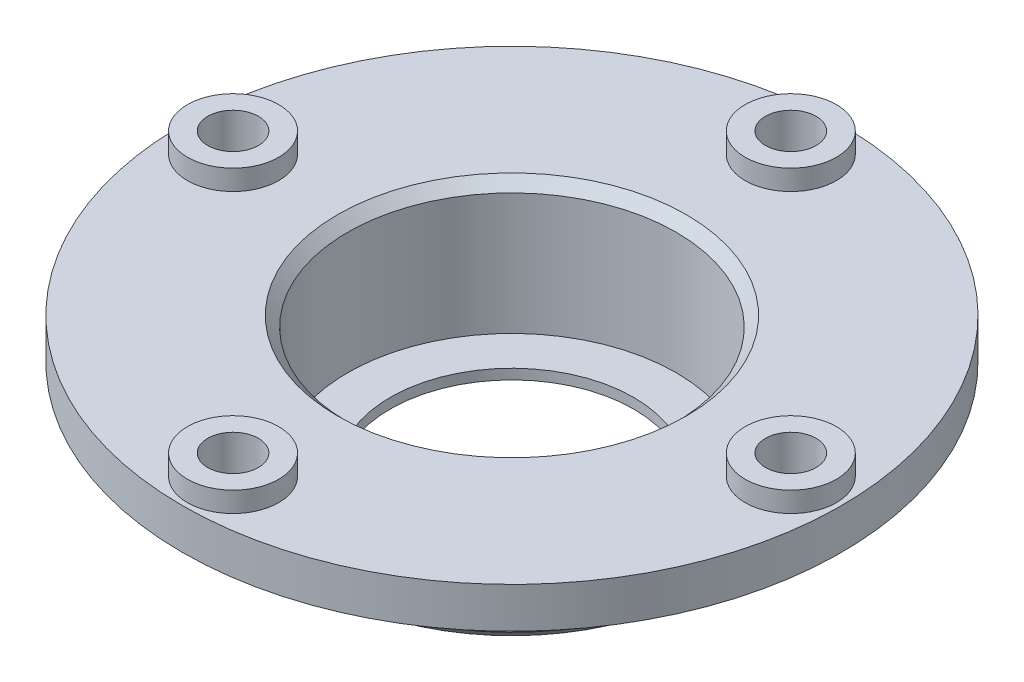
ISO-10303-21;
HEADER;
FILE_DESCRIPTION(('STEP AP214'),'2;1');
FILE_NAME('part.step','',(''),(''),'','','');
FILE_SCHEMA(('AUTOMOTIVE_DESIGN { 1 0 10303 214 1 1 1 1 }'));
ENDSEC;
DATA;
#1=APPLICATION_CONTEXT('core data for automotive mechanical design processes');
#2=APPLICATION_PROTOCOL_DEFINITION('international standard','automotive_design',2000,#1);
#3=PRODUCT_CONTEXT('',#1,'mechanical');
#4=PRODUCT('Part','Part','',(#3));
#5=PRODUCT_RELATED_PRODUCT_CATEGORY('part','',(#4));
#6=PRODUCT_DEFINITION_FORMATION('','',#4);
#7=PRODUCT_DEFINITION_CONTEXT('part definition',#1,'design');
#8=PRODUCT_DEFINITION('design','',#6,#7);
#9=PRODUCT_DEFINITION_SHAPE('','',#8);
#10=(LENGTH_UNIT() NAMED_UNIT(*) SI_UNIT(.MILLI.,.METRE.));
#11=(NAMED_UNIT(*) PLANE_ANGLE_UNIT() SI_UNIT($,.RADIAN.));
#12=(NAMED_UNIT(*) SI_UNIT($,.STERADIAN.) SOLID_ANGLE_UNIT());
#13=UNCERTAINTY_MEASURE_WITH_UNIT(LENGTH_MEASURE(1.E-05),#10,'distance_accuracy_value','');
#14=(GEOMETRIC_REPRESENTATION_CONTEXT(3) GLOBAL_UNCERTAINTY_ASSIGNED_CONTEXT((#13)) GLOBAL_UNIT_ASSIGNED_CONTEXT((#10,
#11,#12)) REPRESENTATION_CONTEXT('',''));
#15=CARTESIAN_POINT('',(0.,0.,0.));
#16=DIRECTION('',(0.,0.,1.));
#17=DIRECTION('',(1.,0.,0.));
#18=AXIS2_PLACEMENT_3D('',#15,#16,#17);
#19=CARTESIAN_POINT('',(0.,9.,0.));
#20=DIRECTION('',(0.,-1.,0.));
#21=DIRECTION('',(0.,0.,-1.));
#22=AXIS2_PLACEMENT_3D('',#19,#20,#21);
#23=CYLINDRICAL_SURFACE('',#22,16.2);
#24=CARTESIAN_POINT('',(0.,13.,0.));
#25=DIRECTION('',(0.,1.,0.));
#26=DIRECTION('',(0.,0.,1.));
#27=AXIS2_PLACEMENT_3D('',#24,#25,#26);
#28=CIRCLE('',#27,16.2);
#29=CARTESIAN_POINT('',(0.,13.,16.2));
#30=VERTEX_POINT('',#29);
#31=EDGE_CURVE('E53',#30,#30,#28,.T.);
#32=ORIENTED_EDGE('',*,*,#31,.T.);
#33=EDGE_LOOP('',(#32));
#34=FACE_BOUND('',#33,.T.);
#35=CARTESIAN_POINT('',(0.,1.,0.));
#36=DIRECTION('',(0.,-1.,0.));
#37=DIRECTION('',(0.,0.,-1.));
#38=AXIS2_PLACEMENT_3D('',#35,#36,#37);
#39=CIRCLE('',#38,16.2);
#40=CARTESIAN_POINT('',(0.,1.,-16.2));
#41=VERTEX_POINT('',#40);
#42=EDGE_CURVE('E120',#41,#41,#39,.T.);
#43=ORIENTED_EDGE('',*,*,#42,.T.);
#44=EDGE_LOOP('',(#43));
#45=FACE_BOUND('',#44,.T.);
#46=ADVANCED_FACE('F37',(#34,#45),#23,.F.);
#47=CARTESIAN_POINT('',(0.,14.,0.));
#48=DIRECTION('',(0.,1.,0.));
#49=DIRECTION('',(0.,0.,1.));
#50=AXIS2_PLACEMENT_3D('',#47,#48,#49);
#51=PLANE('',#50);
#52=CARTESIAN_POINT('',(0.,14.,0.));
#53=DIRECTION('',(0.,1.,0.));
#54=DIRECTION('',(0.,0.,1.));
#55=AXIS2_PLACEMENT_3D('',#52,#53,#54);
#56=CIRCLE('',#55,17.2);
#57=CARTESIAN_POINT('',(0.,14.,17.2));
#58=VERTEX_POINT('',#57);
#59=EDGE_CURVE('E49',#58,#58,#56,.F.);
#60=ORIENTED_EDGE('',*,*,#59,.T.);
#61=EDGE_LOOP('',(#60));
#62=FACE_BOUND('',#61,.T.);
#63=CARTESIAN_POINT('',(27.500000000002,14.,-1.94894085529379E-12));
#64=DIRECTION('',(0.,1.,0.));
#65=DIRECTION('',(0.,0.,1.));
#66=AXIS2_PLACEMENT_3D('',#63,#64,#65);
#67=CIRCLE('',#66,4.50000000000138);
#68=CARTESIAN_POINT('',(27.500000000002,14.,4.49999999999943));
#69=VERTEX_POINT('',#68);
#70=EDGE_CURVE('E107',#69,#69,#67,.T.);
#71=ORIENTED_EDGE('',*,*,#70,.F.);
#72=EDGE_LOOP('',(#71));
#73=FACE_BOUND('',#72,.T.);
#74=CARTESIAN_POINT('',(3.89788171058759E-12,14.,27.5));
#75=DIRECTION('',(0.,1.,0.));
#76=DIRECTION('',(0.,0.,1.));
#77=AXIS2_PLACEMENT_3D('',#74,#75,#76);
#78=CIRCLE('',#77,4.50000000000391);
#79=CARTESIAN_POINT('',(3.89788171058759E-12,14.,32.0000000000039));
#80=VERTEX_POINT('',#79);
#81=EDGE_CURVE('E87',#80,#80,#78,.T.);
#82=ORIENTED_EDGE('',*,*,#81,.F.);
#83=EDGE_LOOP('',(#82));
#84=FACE_BOUND('',#83,.T.);
#85=CARTESIAN_POINT('',(0.,14.,0.));
#86=DIRECTION('',(0.,1.,0.));
#87=DIRECTION('',(0.,0.,1.));
#88=AXIS2_PLACEMENT_3D('',#85,#86,#87);
#89=CIRCLE('',#88,32.5);
#90=CARTESIAN_POINT('',(0.,14.,32.5));
#91=VERTEX_POINT('',#90);
#92=EDGE_CURVE('E83',#91,#91,#89,.T.);
#93=ORIENTED_EDGE('',*,*,#92,.T.);
#94=EDGE_LOOP('',(#93));
#95=FACE_BOUND('',#94,.T.);
#96=CARTESIAN_POINT('',(0.,14.,-27.5));
#97=DIRECTION('',(0.,1.,0.));
#98=DIRECTION('',(0.,0.,1.));
#99=AXIS2_PLACEMENT_3D('',#96,#97,#98);
#100=CIRCLE('',#99,4.5);
#101=CARTESIAN_POINT('',(0.,14.,-23.));
#102=VERTEX_POINT('',#101);
#103=EDGE_CURVE('E98',#102,#102,#100,.T.);
#104=ORIENTED_EDGE('',*,*,#103,.F.);
#105=EDGE_LOOP('',(#104));
#106=FACE_BOUND('',#105,.T.);
#107=CARTESIAN_POINT('',(-27.4999999999981,14.,1.95230863399145E-12));
#108=DIRECTION('',(0.,1.,0.));
#109=DIRECTION('',(0.,0.,1.));
#110=AXIS2_PLACEMENT_3D('',#107,#108,#109);
#111=CIRCLE('',#110,4.50000000000271);
#112=CARTESIAN_POINT('',(-27.4999999999981,14.,4.50000000000466));
#113=VERTEX_POINT('',#112);
#114=EDGE_CURVE('E116',#113,#113,#111,.T.);
#115=ORIENTED_EDGE('',*,*,#114,.F.);
#116=EDGE_LOOP('',(#115));
#117=FACE_BOUND('',#116,.T.);
#118=ADVANCED_FACE('F144',(#62,#73,#84,#95,#106,#117),#51,.T.);
#119=CARTESIAN_POINT('',(0.,0.,0.));
#120=DIRECTION('',(0.,1.,0.));
#121=DIRECTION('',(0.,0.,1.));
#122=AXIS2_PLACEMENT_3D('',#119,#120,#121);
#123=PLANE('',#122);
#124=CARTESIAN_POINT('',(0.,0.,0.));
#125=DIRECTION('',(0.,1.,0.));
#126=DIRECTION('',(0.,0.,1.));
#127=AXIS2_PLACEMENT_3D('',#124,#125,#126);
#128=CIRCLE('',#127,18.9);
#129=CARTESIAN_POINT('',(0.,0.,18.9));
#130=VERTEX_POINT('',#129);
#131=EDGE_CURVE('E10',#130,#130,#128,.F.);
#132=ORIENTED_EDGE('',*,*,#131,.T.);
#133=EDGE_LOOP('',(#132));
#134=FACE_BOUND('',#133,.T.);
#135=CARTESIAN_POINT('',(0.,0.,0.));
#136=DIRECTION('',(0.,-1.,0.));
#137=DIRECTION('',(0.,0.,-1.));
#138=AXIS2_PLACEMENT_3D('',#135,#136,#137);
#139=CIRCLE('',#138,12.);
#140=CARTESIAN_POINT('',(0.,0.,-12.));
#141=VERTEX_POINT('',#140);
#142=EDGE_CURVE('E62',#141,#141,#139,.T.);
#143=ORIENTED_EDGE('',*,*,#142,.F.);
#144=EDGE_LOOP('',(#143));
#145=FACE_BOUND('',#144,.T.);
#146=ADVANCED_FACE('F141',(#134,#145),#123,.F.);
#147=CARTESIAN_POINT('',(0.,9.,0.));
#148=DIRECTION('',(0.,-1.,0.));
#149=DIRECTION('',(0.,0.,-1.));
#150=AXIS2_PLACEMENT_3D('',#147,#148,#149);
#151=CYLINDRICAL_SURFACE('',#150,19.9);
#152=CARTESIAN_POINT('',(0.,0.999999999999994,0.));
#153=DIRECTION('',(0.,1.,0.));
#154=DIRECTION('',(0.,0.,1.));
#155=AXIS2_PLACEMENT_3D('',#152,#153,#154);
#156=CIRCLE('',#155,19.9);
#157=CARTESIAN_POINT('',(0.,0.999999999999994,19.9));
#158=VERTEX_POINT('',#157);
#159=EDGE_CURVE('E45',#158,#158,#156,.T.);
#160=ORIENTED_EDGE('',*,*,#159,.T.);
#161=EDGE_LOOP('',(#160));
#162=FACE_BOUND('',#161,.T.);
#163=CARTESIAN_POINT('',(0.,9.,0.));
#164=DIRECTION('',(0.,1.,0.));
#165=DIRECTION('',(0.,0.,1.));
#166=AXIS2_PLACEMENT_3D('',#163,#164,#165);
#167=CIRCLE('',#166,19.9);
#168=CARTESIAN_POINT('',(0.,9.,19.9));
#169=VERTEX_POINT('',#168);
#170=EDGE_CURVE('E58',#169,#169,#167,.T.);
#171=ORIENTED_EDGE('',*,*,#170,.F.);
#172=EDGE_LOOP('',(#171));
#173=FACE_BOUND('',#172,.T.);
#174=ADVANCED_FACE('F143',(#162,#173),#151,.T.);
#175=CARTESIAN_POINT('',(0.,9.,0.));
#176=DIRECTION('',(0.,1.,0.));
#177=DIRECTION('',(0.,0.,1.));
#178=AXIS2_PLACEMENT_3D('',#175,#176,#177);
#179=PLANE('',#178);
#180=ORIENTED_EDGE('',*,*,#170,.T.);
#181=EDGE_LOOP('',(#180));
#182=FACE_BOUND('',#181,.T.);
#183=CARTESIAN_POINT('',(0.,9.,0.));
#184=DIRECTION('',(0.,1.,0.));
#185=DIRECTION('',(0.,0.,1.));
#186=AXIS2_PLACEMENT_3D('',#183,#184,#185);
#187=CIRCLE('',#186,22.);
#188=CARTESIAN_POINT('',(0.,9.,22.));
#189=VERTEX_POINT('',#188);
#190=EDGE_CURVE('E75',#189,#189,#187,.T.);
#191=ORIENTED_EDGE('',*,*,#190,.F.);
#192=EDGE_LOOP('',(#191));
#193=FACE_BOUND('',#192,.T.);
#194=ADVANCED_FACE('F150',(#182,#193),#179,.F.);
#195=CARTESIAN_POINT('',(0.,10.,0.));
#196=DIRECTION('',(0.,-1.,0.));
#197=DIRECTION('',(0.,0.,-1.));
#198=AXIS2_PLACEMENT_3D('',#195,#196,#197);
#199=CYLINDRICAL_SURFACE('',#198,22.);
#200=CARTESIAN_POINT('',(0.,10.,0.));
#201=DIRECTION('',(0.,1.,0.));
#202=DIRECTION('',(0.,0.,1.));
#203=AXIS2_PLACEMENT_3D('',#200,#201,#202);
#204=CIRCLE('',#203,22.);
#205=CARTESIAN_POINT('',(0.,10.,22.));
#206=VERTEX_POINT('',#205);
#207=EDGE_CURVE('E74',#206,#206,#204,.T.);
#208=ORIENTED_EDGE('',*,*,#207,.F.);
#209=EDGE_LOOP('',(#208));
#210=FACE_BOUND('',#209,.T.);
#211=ORIENTED_EDGE('',*,*,#190,.T.);
#212=EDGE_LOOP('',(#211));
#213=FACE_BOUND('',#212,.T.);
#214=ADVANCED_FACE('F161',(#210,#213),#199,.T.);
#215=CARTESIAN_POINT('',(0.,10.,0.));
#216=DIRECTION('',(0.,1.,0.));
#217=DIRECTION('',(0.,0.,1.));
#218=AXIS2_PLACEMENT_3D('',#215,#216,#217);
#219=PLANE('',#218);
#220=CARTESIAN_POINT('',(3.89788171058759E-12,10.,27.5));
#221=DIRECTION('',(0.,1.,0.));
#222=DIRECTION('',(0.,0.,1.));
#223=AXIS2_PLACEMENT_3D('',#220,#221,#222);
#224=CIRCLE('',#223,2.50000000000391);
#225=CARTESIAN_POINT('',(3.89788171058759E-12,10.,30.0000000000039));
#226=VERTEX_POINT('',#225);
#227=EDGE_CURVE('E59',#226,#226,#224,.T.);
#228=ORIENTED_EDGE('',*,*,#227,.T.);
#229=EDGE_LOOP('',(#228));
#230=FACE_BOUND('',#229,.T.);
#231=CARTESIAN_POINT('',(27.500000000002,10.,-1.94894085529379E-12));
#232=DIRECTION('',(0.,1.,0.));
#233=DIRECTION('',(0.,0.,1.));
#234=AXIS2_PLACEMENT_3D('',#231,#232,#233);
#235=CIRCLE('',#234,2.50000000000138);
#236=CARTESIAN_POINT('',(27.500000000002,10.,2.49999999999944));
#237=VERTEX_POINT('',#236);
#238=EDGE_CURVE('E63',#237,#237,#235,.T.);
#239=ORIENTED_EDGE('',*,*,#238,.T.);
#240=EDGE_LOOP('',(#239));
#241=FACE_BOUND('',#240,.T.);
#242=CARTESIAN_POINT('',(0.,10.,-27.5));
#243=DIRECTION('',(0.,1.,0.));
#244=DIRECTION('',(0.,0.,1.));
#245=AXIS2_PLACEMENT_3D('',#242,#243,#244);
#246=CIRCLE('',#245,2.5);
#247=CARTESIAN_POINT('',(0.,10.,-25.));
#248=VERTEX_POINT('',#247);
#249=EDGE_CURVE('E66',#248,#248,#246,.T.);
#250=ORIENTED_EDGE('',*,*,#249,.T.);
#251=EDGE_LOOP('',(#250));
#252=FACE_BOUND('',#251,.T.);
#253=CARTESIAN_POINT('',(-27.4999999999981,10.,1.95230863399145E-12));
#254=DIRECTION('',(0.,1.,0.));
#255=DIRECTION('',(0.,0.,1.));
#256=AXIS2_PLACEMENT_3D('',#253,#254,#255);
#257=CIRCLE('',#256,2.50000000000271);
#258=CARTESIAN_POINT('',(-27.4999999999981,10.,2.50000000000466));
#259=VERTEX_POINT('',#258);
#260=EDGE_CURVE('E69',#259,#259,#257,.T.);
#261=ORIENTED_EDGE('',*,*,#260,.T.);
#262=EDGE_LOOP('',(#261));
#263=FACE_BOUND('',#262,.T.);
#264=ORIENTED_EDGE('',*,*,#207,.T.);
#265=EDGE_LOOP('',(#264));
#266=FACE_BOUND('',#265,.T.);
#267=CARTESIAN_POINT('',(0.,10.,0.));
#268=DIRECTION('',(0.,1.,0.));
#269=DIRECTION('',(0.,0.,1.));
#270=AXIS2_PLACEMENT_3D('',#267,#268,#269);
#271=CIRCLE('',#270,32.5);
#272=CARTESIAN_POINT('',(0.,10.,32.5));
#273=VERTEX_POINT('',#272);
#274=EDGE_CURVE('E78',#273,#273,#271,.T.);
#275=ORIENTED_EDGE('',*,*,#274,.F.);
#276=EDGE_LOOP('',(#275));
#277=FACE_BOUND('',#276,.T.);
#278=ADVANCED_FACE('F164',(#230,#241,#252,#263,#266,#277),#219,.F.);
#279=CARTESIAN_POINT('',(0.,11.,0.));
#280=DIRECTION('',(0.,-1.,0.));
#281=DIRECTION('',(0.,0.,-1.));
#282=AXIS2_PLACEMENT_3D('',#279,#280,#281);
#283=CYLINDRICAL_SURFACE('',#282,32.5);
#284=ORIENTED_EDGE('',*,*,#274,.T.);
#285=EDGE_LOOP('',(#284));
#286=FACE_BOUND('',#285,.T.);
#287=ORIENTED_EDGE('',*,*,#92,.F.);
#288=EDGE_LOOP('',(#287));
#289=FACE_BOUND('',#288,.T.);
#290=ADVANCED_FACE('F169',(#286,#289),#283,.T.);
#291=CARTESIAN_POINT('',(3.89788171058759E-12,16.,27.5));
#292=DIRECTION('',(0.,1.,0.));
#293=DIRECTION('',(0.,0.,1.));
#294=AXIS2_PLACEMENT_3D('',#291,#292,#293);
#295=PLANE('',#294);
#296=CARTESIAN_POINT('',(3.89788171058759E-12,16.,27.5));
#297=DIRECTION('',(0.,1.,0.));
#298=DIRECTION('',(0.,0.,1.));
#299=AXIS2_PLACEMENT_3D('',#296,#297,#298);
#300=CIRCLE('',#299,4.50000000000391);
#301=CARTESIAN_POINT('',(3.89788171058759E-12,16.,32.0000000000039));
#302=VERTEX_POINT('',#301);
#303=EDGE_CURVE('E86',#302,#302,#300,.T.);
#304=ORIENTED_EDGE('',*,*,#303,.T.);
#305=EDGE_LOOP('',(#304));
#306=FACE_BOUND('',#305,.T.);
#307=CARTESIAN_POINT('',(3.89788171058759E-12,16.,27.5));
#308=DIRECTION('',(0.,1.,0.));
#309=DIRECTION('',(0.,0.,1.));
#310=AXIS2_PLACEMENT_3D('',#307,#308,#309);
#311=CIRCLE('',#310,2.50000000000391);
#312=CARTESIAN_POINT('',(3.89788171058759E-12,16.,30.0000000000039));
#313=VERTEX_POINT('',#312);
#314=EDGE_CURVE('E90',#313,#313,#311,.T.);
#315=ORIENTED_EDGE('',*,*,#314,.F.);
#316=EDGE_LOOP('',(#315));
#317=FACE_BOUND('',#316,.T.);
#318=ADVANCED_FACE('F172',(#306,#317),#295,.T.);
#319=CARTESIAN_POINT('',(3.89788171058759E-12,16.,27.5));
#320=DIRECTION('',(0.,-1.,0.));
#321=DIRECTION('',(0.,0.,-1.));
#322=AXIS2_PLACEMENT_3D('',#319,#320,#321);
#323=CYLINDRICAL_SURFACE('',#322,4.50000000000391);
#324=ORIENTED_EDGE('',*,*,#303,.F.);
#325=EDGE_LOOP('',(#324));
#326=FACE_BOUND('',#325,.T.);
#327=ORIENTED_EDGE('',*,*,#81,.T.);
#328=EDGE_LOOP('',(#327));
#329=FACE_BOUND('',#328,.T.);
#330=ADVANCED_FACE('F193',(#326,#329),#323,.T.);
#331=CARTESIAN_POINT('',(3.89788171058759E-12,14.,27.5));
#332=DIRECTION('',(0.,-1.,0.));
#333=DIRECTION('',(0.,0.,-1.));
#334=AXIS2_PLACEMENT_3D('',#331,#332,#333);
#335=CYLINDRICAL_SURFACE('',#334,2.50000000000391);
#336=ORIENTED_EDGE('',*,*,#314,.T.);
#337=EDGE_LOOP('',(#336));
#338=FACE_BOUND('',#337,.T.);
#339=ORIENTED_EDGE('',*,*,#227,.F.);
#340=EDGE_LOOP('',(#339));
#341=FACE_BOUND('',#340,.T.);
#342=ADVANCED_FACE('F189',(#338,#341),#335,.F.);
#343=CARTESIAN_POINT('',(0.,16.,-27.5));
#344=DIRECTION('',(0.,1.,0.));
#345=DIRECTION('',(0.,0.,1.));
#346=AXIS2_PLACEMENT_3D('',#343,#344,#345);
#347=PLANE('',#346);
#348=CARTESIAN_POINT('',(0.,16.,-27.5));
#349=DIRECTION('',(0.,1.,0.));
#350=DIRECTION('',(0.,0.,1.));
#351=AXIS2_PLACEMENT_3D('',#348,#349,#350);
#352=CIRCLE('',#351,4.5);
#353=CARTESIAN_POINT('',(0.,16.,-23.));
#354=VERTEX_POINT('',#353);
#355=EDGE_CURVE('E99',#354,#354,#352,.T.);
#356=ORIENTED_EDGE('',*,*,#355,.T.);
#357=EDGE_LOOP('',(#356));
#358=FACE_BOUND('',#357,.T.);
#359=CARTESIAN_POINT('',(0.,16.,-27.5));
#360=DIRECTION('',(0.,1.,0.));
#361=DIRECTION('',(0.,0.,1.));
#362=AXIS2_PLACEMENT_3D('',#359,#360,#361);
#363=CIRCLE('',#362,2.5);
#364=CARTESIAN_POINT('',(0.,16.,-25.));
#365=VERTEX_POINT('',#364);
#366=EDGE_CURVE('E95',#365,#365,#363,.T.);
#367=ORIENTED_EDGE('',*,*,#366,.F.);
#368=EDGE_LOOP('',(#367));
#369=FACE_BOUND('',#368,.T.);
#370=ADVANCED_FACE('F192',(#358,#369),#347,.T.);
#371=CARTESIAN_POINT('',(0.,16.,-27.5));
#372=DIRECTION('',(0.,-1.,0.));
#373=DIRECTION('',(0.,0.,-1.));
#374=AXIS2_PLACEMENT_3D('',#371,#372,#373);
#375=CYLINDRICAL_SURFACE('',#374,4.5);
#376=ORIENTED_EDGE('',*,*,#355,.F.);
#377=EDGE_LOOP('',(#376));
#378=FACE_BOUND('',#377,.T.);
#379=ORIENTED_EDGE('',*,*,#103,.T.);
#380=EDGE_LOOP('',(#379));
#381=FACE_BOUND('',#380,.T.);
#382=ADVANCED_FACE('F181',(#378,#381),#375,.T.);
#383=CARTESIAN_POINT('',(0.,14.,-27.5));
#384=DIRECTION('',(0.,-1.,0.));
#385=DIRECTION('',(0.,0.,-1.));
#386=AXIS2_PLACEMENT_3D('',#383,#384,#385);
#387=CYLINDRICAL_SURFACE('',#386,2.5);
#388=ORIENTED_EDGE('',*,*,#366,.T.);
#389=EDGE_LOOP('',(#388));
#390=FACE_BOUND('',#389,.T.);
#391=ORIENTED_EDGE('',*,*,#249,.F.);
#392=EDGE_LOOP('',(#391));
#393=FACE_BOUND('',#392,.T.);
#394=ADVANCED_FACE('F177',(#390,#393),#387,.F.);
#395=CARTESIAN_POINT('',(27.500000000002,16.,-1.94894085529379E-12));
#396=DIRECTION('',(0.,1.,0.));
#397=DIRECTION('',(0.,0.,1.));
#398=AXIS2_PLACEMENT_3D('',#395,#396,#397);
#399=PLANE('',#398);
#400=CARTESIAN_POINT('',(27.500000000002,16.,-1.94894085529379E-12));
#401=DIRECTION('',(0.,1.,0.));
#402=DIRECTION('',(0.,0.,1.));
#403=AXIS2_PLACEMENT_3D('',#400,#401,#402);
#404=CIRCLE('',#403,4.50000000000138);
#405=CARTESIAN_POINT('',(27.500000000002,16.,4.49999999999943));
#406=VERTEX_POINT('',#405);
#407=EDGE_CURVE('E108',#406,#406,#404,.T.);
#408=ORIENTED_EDGE('',*,*,#407,.T.);
#409=EDGE_LOOP('',(#408));
#410=FACE_BOUND('',#409,.T.);
#411=CARTESIAN_POINT('',(27.500000000002,16.,-1.94894085529379E-12));
#412=DIRECTION('',(0.,1.,0.));
#413=DIRECTION('',(0.,0.,1.));
#414=AXIS2_PLACEMENT_3D('',#411,#412,#413);
#415=CIRCLE('',#414,2.50000000000138);
#416=CARTESIAN_POINT('',(27.500000000002,16.,2.49999999999944));
#417=VERTEX_POINT('',#416);
#418=EDGE_CURVE('E102',#417,#417,#415,.T.);
#419=ORIENTED_EDGE('',*,*,#418,.F.);
#420=EDGE_LOOP('',(#419));
#421=FACE_BOUND('',#420,.T.);
#422=ADVANCED_FACE('F180',(#410,#421),#399,.T.);
#423=CARTESIAN_POINT('',(27.500000000002,16.,-1.94894085529379E-12));
#424=DIRECTION('',(0.,-1.,0.));
#425=DIRECTION('',(0.,0.,-1.));
#426=AXIS2_PLACEMENT_3D('',#423,#424,#425);
#427=CYLINDRICAL_SURFACE('',#426,4.50000000000138);
#428=ORIENTED_EDGE('',*,*,#407,.F.);
#429=EDGE_LOOP('',(#428));
#430=FACE_BOUND('',#429,.T.);
#431=ORIENTED_EDGE('',*,*,#70,.T.);
#432=EDGE_LOOP('',(#431));
#433=FACE_BOUND('',#432,.T.);
#434=ADVANCED_FACE('F187',(#430,#433),#427,.T.);
#435=CARTESIAN_POINT('',(27.500000000002,14.,-1.94894085529379E-12));
#436=DIRECTION('',(0.,-1.,0.));
#437=DIRECTION('',(0.,0.,-1.));
#438=AXIS2_PLACEMENT_3D('',#435,#436,#437);
#439=CYLINDRICAL_SURFACE('',#438,2.50000000000138);
#440=ORIENTED_EDGE('',*,*,#418,.T.);
#441=EDGE_LOOP('',(#440));
#442=FACE_BOUND('',#441,.T.);
#443=ORIENTED_EDGE('',*,*,#238,.F.);
#444=EDGE_LOOP('',(#443));
#445=FACE_BOUND('',#444,.T.);
#446=ADVANCED_FACE('F183',(#442,#445),#439,.F.);
#447=CARTESIAN_POINT('',(-27.4999999999981,16.,1.95230863399145E-12));
#448=DIRECTION('',(0.,1.,0.));
#449=DIRECTION('',(0.,0.,1.));
#450=AXIS2_PLACEMENT_3D('',#447,#448,#449);
#451=PLANE('',#450);
#452=CARTESIAN_POINT('',(-27.4999999999981,16.,1.95230863399145E-12));
#453=DIRECTION('',(0.,1.,0.));
#454=DIRECTION('',(0.,0.,1.));
#455=AXIS2_PLACEMENT_3D('',#452,#453,#454);
#456=CIRCLE('',#455,4.50000000000271);
#457=CARTESIAN_POINT('',(-27.4999999999981,16.,4.50000000000466));
#458=VERTEX_POINT('',#457);
#459=EDGE_CURVE('E117',#458,#458,#456,.T.);
#460=ORIENTED_EDGE('',*,*,#459,.T.);
#461=EDGE_LOOP('',(#460));
#462=FACE_BOUND('',#461,.T.);
#463=CARTESIAN_POINT('',(-27.4999999999981,16.,1.95230863399145E-12));
#464=DIRECTION('',(0.,1.,0.));
#465=DIRECTION('',(0.,0.,1.));
#466=AXIS2_PLACEMENT_3D('',#463,#464,#465);
#467=CIRCLE('',#466,2.50000000000271);
#468=CARTESIAN_POINT('',(-27.4999999999981,16.,2.50000000000466));
#469=VERTEX_POINT('',#468);
#470=EDGE_CURVE('E111',#469,#469,#467,.T.);
#471=ORIENTED_EDGE('',*,*,#470,.F.);
#472=EDGE_LOOP('',(#471));
#473=FACE_BOUND('',#472,.T.);
#474=ADVANCED_FACE('F186',(#462,#473),#451,.T.);
#475=CARTESIAN_POINT('',(-27.4999999999981,16.,1.95230863399145E-12));
#476=DIRECTION('',(0.,-1.,0.));
#477=DIRECTION('',(0.,0.,-1.));
#478=AXIS2_PLACEMENT_3D('',#475,#476,#477);
#479=CYLINDRICAL_SURFACE('',#478,4.50000000000271);
#480=ORIENTED_EDGE('',*,*,#459,.F.);
#481=EDGE_LOOP('',(#480));
#482=FACE_BOUND('',#481,.T.);
#483=ORIENTED_EDGE('',*,*,#114,.T.);
#484=EDGE_LOOP('',(#483));
#485=FACE_BOUND('',#484,.T.);
#486=ADVANCED_FACE('F198',(#482,#485),#479,.T.);
#487=CARTESIAN_POINT('',(-27.4999999999981,14.,1.95230863399145E-12));
#488=DIRECTION('',(0.,-1.,0.));
#489=DIRECTION('',(0.,0.,-1.));
#490=AXIS2_PLACEMENT_3D('',#487,#488,#489);
#491=CYLINDRICAL_SURFACE('',#490,2.50000000000271);
#492=ORIENTED_EDGE('',*,*,#470,.T.);
#493=EDGE_LOOP('',(#492));
#494=FACE_BOUND('',#493,.T.);
#495=ORIENTED_EDGE('',*,*,#260,.F.);
#496=EDGE_LOOP('',(#495));
#497=FACE_BOUND('',#496,.T.);
#498=ADVANCED_FACE('F195',(#494,#497),#491,.F.);
#499=CARTESIAN_POINT('',(0.,1.,0.));
#500=DIRECTION('',(0.,-1.,0.));
#501=DIRECTION('',(0.,0.,-1.));
#502=AXIS2_PLACEMENT_3D('',#499,#500,#501);
#503=PLANE('',#502);
#504=CARTESIAN_POINT('',(0.,1.,0.));
#505=DIRECTION('',(0.,-1.,0.));
#506=DIRECTION('',(0.,0.,-1.));
#507=AXIS2_PLACEMENT_3D('',#504,#505,#506);
#508=CIRCLE('',#507,12.);
#509=CARTESIAN_POINT('',(0.,1.,-12.));
#510=VERTEX_POINT('',#509);
#511=EDGE_CURVE('E125',#510,#510,#508,.T.);
#512=ORIENTED_EDGE('',*,*,#511,.T.);
#513=EDGE_LOOP('',(#512));
#514=FACE_BOUND('',#513,.T.);
#515=ORIENTED_EDGE('',*,*,#42,.F.);
#516=EDGE_LOOP('',(#515));
#517=FACE_BOUND('',#516,.T.);
#518=ADVANCED_FACE('F131',(#514,#517),#503,.F.);
#519=CARTESIAN_POINT('',(0.,1.,0.));
#520=DIRECTION('',(0.,-1.,0.));
#521=DIRECTION('',(0.,0.,-1.));
#522=AXIS2_PLACEMENT_3D('',#519,#520,#521);
#523=CYLINDRICAL_SURFACE('',#522,12.);
#524=ORIENTED_EDGE('',*,*,#511,.F.);
#525=EDGE_LOOP('',(#524));
#526=FACE_BOUND('',#525,.T.);
#527=ORIENTED_EDGE('',*,*,#142,.T.);
#528=EDGE_LOOP('',(#527));
#529=FACE_BOUND('',#528,.T.);
#530=ADVANCED_FACE('F134',(#526,#529),#523,.F.);
#531=CARTESIAN_POINT('',(0.,13.,0.));
#532=DIRECTION('',(0.,1.,0.));
#533=DIRECTION('',(0.,0.,1.));
#534=AXIS2_PLACEMENT_3D('',#531,#532,#533);
#535=CONICAL_SURFACE('',#534,16.2,0.785398163397455);
#536=ORIENTED_EDGE('',*,*,#59,.F.);
#537=EDGE_LOOP('',(#536));
#538=FACE_BOUND('',#537,.T.);
#539=ORIENTED_EDGE('',*,*,#31,.F.);
#540=EDGE_LOOP('',(#539));
#541=FACE_BOUND('',#540,.T.);
#542=ADVANCED_FACE('F137',(#538,#541),#535,.F.);
#543=CARTESIAN_POINT('',(0.,0.999999999999994,0.));
#544=DIRECTION('',(0.,1.,0.));
#545=DIRECTION('',(0.,0.,1.));
#546=AXIS2_PLACEMENT_3D('',#543,#544,#545);
#547=CONICAL_SURFACE('',#546,19.9,0.78539816339745);
#548=ORIENTED_EDGE('',*,*,#131,.F.);
#549=EDGE_LOOP('',(#548));
#550=FACE_BOUND('',#549,.T.);
#551=ORIENTED_EDGE('',*,*,#159,.F.);
#552=EDGE_LOOP('',(#551));
#553=FACE_BOUND('',#552,.T.);
#554=ADVANCED_FACE('F40',(#550,#553),#547,.T.);
#555=CLOSED_SHELL('',(#46,#118,#146,#174,#194,#214,#278,#290,#318,#330,#342,#370,#382,#394,#422,
#434,#446,#474,#486,#498,#518,#530,#542,#554));
#556=MANIFOLD_SOLID_BREP('B2',#555);
#557=ADVANCED_BREP_SHAPE_REPRESENTATION('',(#18,#556),#14);
#558=SHAPE_DEFINITION_REPRESENTATION(#9,#557);
ENDSEC;
END-ISO-10303-21;
